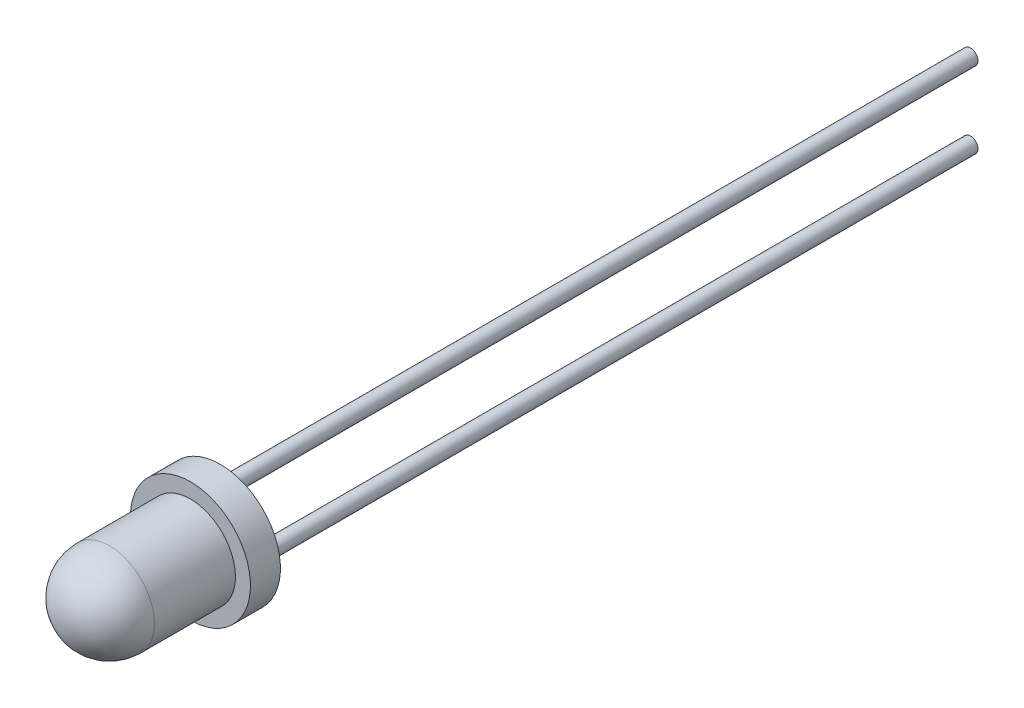
ISO-10303-21;
HEADER;
FILE_DESCRIPTION(('STEP AP214'),'2;1');
FILE_NAME('part.step','',(''),(''),'','','');
FILE_SCHEMA(('AUTOMOTIVE_DESIGN { 1 0 10303 214 1 1 1 1 }'));
ENDSEC;
DATA;
#1=APPLICATION_CONTEXT('core data for automotive mechanical design processes');
#2=APPLICATION_PROTOCOL_DEFINITION('international standard','automotive_design',2000,#1);
#3=PRODUCT_CONTEXT('',#1,'mechanical');
#4=PRODUCT('Part','Part','',(#3));
#5=PRODUCT_RELATED_PRODUCT_CATEGORY('part','',(#4));
#6=PRODUCT_DEFINITION_FORMATION('','',#4);
#7=PRODUCT_DEFINITION_CONTEXT('part definition',#1,'design');
#8=PRODUCT_DEFINITION('design','',#6,#7);
#9=PRODUCT_DEFINITION_SHAPE('','',#8);
#10=(LENGTH_UNIT() NAMED_UNIT(*) SI_UNIT(.MILLI.,.METRE.));
#11=(NAMED_UNIT(*) PLANE_ANGLE_UNIT() SI_UNIT($,.RADIAN.));
#12=(NAMED_UNIT(*) SI_UNIT($,.STERADIAN.) SOLID_ANGLE_UNIT());
#13=UNCERTAINTY_MEASURE_WITH_UNIT(LENGTH_MEASURE(1.E-05),#10,'distance_accuracy_value','');
#14=(GEOMETRIC_REPRESENTATION_CONTEXT(3) GLOBAL_UNCERTAINTY_ASSIGNED_CONTEXT((#13)) GLOBAL_UNIT_ASSIGNED_CONTEXT((#10,
#11,#12)) REPRESENTATION_CONTEXT('',''));
#15=CARTESIAN_POINT('',(0.,0.,0.));
#16=DIRECTION('',(0.,0.,1.));
#17=DIRECTION('',(1.,0.,0.));
#18=AXIS2_PLACEMENT_3D('',#15,#16,#17);
#19=CARTESIAN_POINT('',(0.,0.,4.2));
#20=DIRECTION('',(0.,0.,-1.));
#21=DIRECTION('',(-1.,0.,0.));
#22=AXIS2_PLACEMENT_3D('',#19,#20,#21);
#23=CYLINDRICAL_SURFACE('',#22,1.5);
#24=CARTESIAN_POINT('',(0.,0.,2.7));
#25=DIRECTION('',(0.,0.,-1.));
#26=DIRECTION('',(-1.,0.,0.));
#27=AXIS2_PLACEMENT_3D('',#24,#25,#26);
#28=CIRCLE('',#27,1.5);
#29=CARTESIAN_POINT('',(-1.5,0.,2.7));
#30=VERTEX_POINT('',#29);
#31=EDGE_CURVE('E104',#30,#30,#28,.T.);
#32=ORIENTED_EDGE('',*,*,#31,.T.);
#33=EDGE_LOOP('',(#32));
#34=FACE_BOUND('',#33,.T.);
#35=CARTESIAN_POINT('',(0.,0.,0.));
#36=DIRECTION('',(0.,0.,-1.));
#37=DIRECTION('',(-1.,0.,0.));
#38=AXIS2_PLACEMENT_3D('',#35,#36,#37);
#39=CIRCLE('',#38,1.5);
#40=CARTESIAN_POINT('',(-1.5,0.,0.));
#41=VERTEX_POINT('',#40);
#42=EDGE_CURVE('E99',#41,#41,#39,.T.);
#43=ORIENTED_EDGE('',*,*,#42,.F.);
#44=EDGE_LOOP('',(#43));
#45=FACE_BOUND('',#44,.T.);
#46=ADVANCED_FACE('F38',(#34,#45),#23,.T.);
#47=CARTESIAN_POINT('',(0.,0.,2.7));
#48=DIRECTION('',(0.,0.,1.));
#49=DIRECTION('',(1.,0.,0.));
#50=AXIS2_PLACEMENT_3D('',#47,#48,#49);
#51=SPHERICAL_SURFACE('',#50,1.5);
#52=ORIENTED_EDGE('',*,*,#31,.F.);
#53=EDGE_LOOP('',(#52));
#54=FACE_BOUND('',#53,.T.);
#55=ADVANCED_FACE('F132',(#54),#51,.T.);
#56=CARTESIAN_POINT('',(0.,0.,-1.));
#57=DIRECTION('',(0.,0.,1.));
#58=DIRECTION('',(1.,0.,0.));
#59=AXIS2_PLACEMENT_3D('',#56,#57,#58);
#60=CYLINDRICAL_SURFACE('',#59,2.);
#61=CARTESIAN_POINT('',(0.,0.,-1.));
#62=DIRECTION('',(0.,0.,-1.));
#63=DIRECTION('',(-1.,0.,0.));
#64=AXIS2_PLACEMENT_3D('',#61,#62,#63);
#65=CIRCLE('',#64,2.);
#66=CARTESIAN_POINT('',(-2.,0.,-1.));
#67=VERTEX_POINT('',#66);
#68=EDGE_CURVE('E96',#67,#67,#65,.T.);
#69=ORIENTED_EDGE('',*,*,#68,.F.);
#70=EDGE_LOOP('',(#69));
#71=FACE_BOUND('',#70,.T.);
#72=CARTESIAN_POINT('',(0.,0.,0.));
#73=DIRECTION('',(0.,0.,-1.));
#74=DIRECTION('',(-1.,0.,0.));
#75=AXIS2_PLACEMENT_3D('',#72,#73,#74);
#76=CIRCLE('',#75,2.);
#77=CARTESIAN_POINT('',(-2.,0.,0.));
#78=VERTEX_POINT('',#77);
#79=EDGE_CURVE('E71',#78,#78,#76,.T.);
#80=ORIENTED_EDGE('',*,*,#79,.T.);
#81=EDGE_LOOP('',(#80));
#82=FACE_BOUND('',#81,.T.);
#83=ADVANCED_FACE('F126',(#71,#82),#60,.T.);
#84=CARTESIAN_POINT('',(0.,0.,-1.));
#85=DIRECTION('',(0.,0.,-1.));
#86=DIRECTION('',(-1.,0.,0.));
#87=AXIS2_PLACEMENT_3D('',#84,#85,#86);
#88=PLANE('',#87);
#89=CARTESIAN_POINT('',(0.,-1.27,-1.));
#90=DIRECTION('',(0.,0.,-1.));
#91=DIRECTION('',(-1.,0.,0.));
#92=AXIS2_PLACEMENT_3D('',#89,#90,#91);
#93=CIRCLE('',#92,0.25);
#94=CARTESIAN_POINT('',(0.106415684222751,-1.49622047244094,-1.));
#95=VERTEX_POINT('',#94);
#96=CARTESIAN_POINT('',(-0.106415684222751,-1.49622047244094,-1.));
#97=VERTEX_POINT('',#96);
#98=EDGE_CURVE('E75',#95,#97,#93,.T.);
#99=ORIENTED_EDGE('',*,*,#98,.F.);
#100=CARTESIAN_POINT('',(0.,0.,-1.));
#101=DIRECTION('',(0.,0.,-1.));
#102=DIRECTION('',(-1.,0.,0.));
#103=AXIS2_PLACEMENT_3D('',#100,#101,#102);
#104=CIRCLE('',#103,1.5);
#105=CARTESIAN_POINT('',(0.106415684222752,1.49622047244094,-1.));
#106=VERTEX_POINT('',#105);
#107=EDGE_CURVE('E65',#106,#95,#104,.T.);
#108=ORIENTED_EDGE('',*,*,#107,.F.);
#109=CARTESIAN_POINT('',(0.,1.27,-1.));
#110=DIRECTION('',(0.,0.,-1.));
#111=DIRECTION('',(-1.,0.,0.));
#112=AXIS2_PLACEMENT_3D('',#109,#110,#111);
#113=CIRCLE('',#112,0.25);
#114=CARTESIAN_POINT('',(-0.106415684222751,1.49622047244094,-1.));
#115=VERTEX_POINT('',#114);
#116=EDGE_CURVE('E94',#115,#106,#113,.T.);
#117=ORIENTED_EDGE('',*,*,#116,.F.);
#118=EDGE_CURVE('E72',#97,#115,#104,.T.);
#119=ORIENTED_EDGE('',*,*,#118,.F.);
#120=EDGE_LOOP('',(#99,#108,#117,#119));
#121=FACE_BOUND('',#120,.T.);
#122=ORIENTED_EDGE('',*,*,#68,.T.);
#123=EDGE_LOOP('',(#122));
#124=FACE_BOUND('',#123,.T.);
#125=ADVANCED_FACE('F76',(#121,#124),#88,.T.);
#126=CARTESIAN_POINT('',(0.,0.,0.));
#127=DIRECTION('',(0.,0.,-1.));
#128=DIRECTION('',(-1.,0.,0.));
#129=AXIS2_PLACEMENT_3D('',#126,#127,#128);
#130=PLANE('',#129);
#131=ORIENTED_EDGE('',*,*,#42,.T.);
#132=EDGE_LOOP('',(#131));
#133=FACE_BOUND('',#132,.T.);
#134=ORIENTED_EDGE('',*,*,#79,.F.);
#135=EDGE_LOOP('',(#134));
#136=FACE_BOUND('',#135,.T.);
#137=ADVANCED_FACE('F122',(#133,#136),#130,.F.);
#138=CARTESIAN_POINT('',(0.,0.,-1.5));
#139=DIRECTION('',(0.,0.,-1.));
#140=DIRECTION('',(-1.,0.,0.));
#141=AXIS2_PLACEMENT_3D('',#138,#139,#140);
#142=PLANE('',#141);
#143=CARTESIAN_POINT('',(0.,0.,-1.5));
#144=DIRECTION('',(0.,0.,-1.));
#145=DIRECTION('',(-1.,0.,0.));
#146=AXIS2_PLACEMENT_3D('',#143,#144,#145);
#147=CIRCLE('',#146,1.);
#148=CARTESIAN_POINT('',(-1.,0.,-1.5));
#149=VERTEX_POINT('',#148);
#150=EDGE_CURVE('E107',#149,#149,#147,.T.);
#151=ORIENTED_EDGE('',*,*,#150,.T.);
#152=EDGE_LOOP('',(#151));
#153=FACE_BOUND('',#152,.T.);
#154=ADVANCED_FACE('F119',(#153),#142,.T.);
#155=CARTESIAN_POINT('',(0.,0.,-1.5));
#156=DIRECTION('',(0.,0.,1.));
#157=DIRECTION('',(1.,0.,0.));
#158=AXIS2_PLACEMENT_3D('',#155,#156,#157);
#159=CONICAL_SURFACE('',#158,1.,0.785398163397446);
#160=CARTESIAN_POINT('',(-0.105912034737506,-1.49645670866142,-0.9998));
#161=CARTESIAN_POINT('',(-0.118985530882756,-1.49034383876274,-1.00497380533922));
#162=CARTESIAN_POINT('',(-0.131178028123813,-1.48326350862652,-1.01099521371868));
#163=CARTESIAN_POINT('',(-0.153631408949689,-1.46769100470375,-1.02433803471055));
#164=CARTESIAN_POINT('',(-0.163909364321516,-1.45921272055828,-1.03164670191562));
#165=CARTESIAN_POINT('',(-0.184725750820342,-1.43920377241162,-1.04904534897251));
#166=CARTESIAN_POINT('',(-0.194797883921699,-1.42741634453143,-1.05939058312987));
#167=CARTESIAN_POINT('',(-0.212305714472714,-1.40287086815621,-1.08119355942588));
#168=CARTESIAN_POINT('',(-0.219729656076977,-1.39010878969365,-1.09265598151871));
#169=CARTESIAN_POINT('',(-0.233922181212585,-1.36017392520252,-1.11989922398407));
#170=CARTESIAN_POINT('',(-0.239822077303624,-1.34282901268487,-1.13594197543377));
#171=CARTESIAN_POINT('',(-0.247740720215172,-1.30799751174468,-1.16876606630962));
#172=CARTESIAN_POINT('',(-0.249759188246517,-1.29051091323593,-1.18554745870119));
#173=CARTESIAN_POINT('',(-0.250204005237497,-1.25556273061883,-1.21975521993903));
#174=CARTESIAN_POINT('',(-0.248569293489678,-1.23810652619961,-1.23718769116248));
#175=CARTESIAN_POINT('',(-0.24173477255258,-1.20390407126997,-1.2720666707157));
#176=CARTESIAN_POINT('',(-0.236533582426173,-1.18715809842843,-1.28951318186721));
#177=CARTESIAN_POINT('',(-0.223073588181716,-1.15595893013547,-1.32271880959084));
#178=CARTESIAN_POINT('',(-0.215068670849479,-1.14142772930417,-1.33850745610135));
#179=CARTESIAN_POINT('',(-0.195827351884466,-1.11367850003718,-1.36925790408943));
#180=CARTESIAN_POINT('',(-0.184596545175542,-1.10045825086107,-1.38422108413374));
#181=CARTESIAN_POINT('',(-0.163324790959822,-1.0803849749168,-1.40736114468122));
#182=CARTESIAN_POINT('',(-0.154342917987289,-1.07296784524692,-1.41602323631608));
#183=CARTESIAN_POINT('',(-0.134827132686172,-1.0591342720511,-1.43235440905635));
#184=CARTESIAN_POINT('',(-0.124295479722689,-1.05271639931545,-1.4400249056956));
#185=CARTESIAN_POINT('',(-0.104356506298617,-1.04261778905396,-1.45220369481327));
#186=CARTESIAN_POINT('',(-0.0952901193844546,-1.03865017724314,-1.45702854010391));
#187=CARTESIAN_POINT('',(-0.076273867094625,-1.03170548949875,-1.46551946599306));
#188=CARTESIAN_POINT('',(-0.0663253318017086,-1.02872695338597,-1.46918725435872));
#189=CARTESIAN_POINT('',(-0.0474472462789842,-1.02438606448341,-1.47455052161706));
#190=CARTESIAN_POINT('',(-0.0386262137694067,-1.02283654640068,-1.47647348338028));
#191=CARTESIAN_POINT('',(-0.0206934312584574,-1.02069474360952,-1.47913444240587));
#192=CARTESIAN_POINT('',(-0.0115818905566035,-1.02010178494957,-1.47987327395418));
#193=CARTESIAN_POINT('',(0.00668150278806067,-1.01992222919943,-1.48009682628794));
#194=CARTESIAN_POINT('',(0.0158333967501045,-1.0203372571161,-1.47957952201759));
#195=CARTESIAN_POINT('',(0.0338894581311526,-1.02214124802402,-1.47733682673414));
#196=CARTESIAN_POINT('',(0.042793494079681,-1.02353071802288,-1.47561080682027));
#197=CARTESIAN_POINT('',(0.0600520597366538,-1.02716079340279,-1.47112036506019));
#198=CARTESIAN_POINT('',(0.0684110245073492,-1.02939314522588,-1.46836601552887));
#199=CARTESIAN_POINT('',(0.0845530068372522,-1.03457953915415,-1.46200086802738));
#200=CARTESIAN_POINT('',(0.0923357878889793,-1.0375338754974,-1.45838972089484));
#201=CARTESIAN_POINT('',(0.11193201624513,-1.04606669922907,-1.44802565368745));
#202=CARTESIAN_POINT('',(0.123238901533022,-1.05213393866504,-1.4407162683123));
#203=CARTESIAN_POINT('',(0.144231259315966,-1.06542113363457,-1.42490331318606));
#204=CARTESIAN_POINT('',(0.153911643330935,-1.07264457357866,-1.41639614334034));
#205=CARTESIAN_POINT('',(0.176096511777509,-1.09168586428629,-1.39426228035643));
#206=CARTESIAN_POINT('',(0.187677222650053,-1.10402682475184,-1.38016156269531));
#207=CARTESIAN_POINT('',(0.207786282481997,-1.13001792336977,-1.3510618235121));
#208=CARTESIAN_POINT('',(0.216311944108939,-1.14366920080941,-1.33606202459522));
#209=CARTESIAN_POINT('',(0.230779800190659,-1.1724796733434,-1.30503216684439));
#210=CARTESIAN_POINT('',(0.236608484642438,-1.18767688454914,-1.28898473347982));
#211=CARTESIAN_POINT('',(0.245232545910398,-1.21879700840666,-1.25677661146828));
#212=CARTESIAN_POINT('',(0.248026616140888,-1.2347202305782,-1.24061587704991));
#213=CARTESIAN_POINT('',(0.250775697134881,-1.27051285584141,-1.20497695093739));
#214=CARTESIAN_POINT('',(0.24998172029994,-1.29048778836548,-1.18554108936442));
#215=CARTESIAN_POINT('',(0.243424193701,-1.33044801729457,-1.1474842410381));
#216=CARTESIAN_POINT('',(0.237662850793587,-1.35043330515907,-1.12886289627819));
#217=CARTESIAN_POINT('',(0.223500628955987,-1.38290412459649,-1.09917232391778));
#218=CARTESIAN_POINT('',(0.216631307239347,-1.39565854938512,-1.08766348280188));
#219=CARTESIAN_POINT('',(0.200320681217358,-1.42029623548495,-1.06568052938085));
#220=CARTESIAN_POINT('',(0.190891424574661,-1.43218325461786,-1.05520187576815));
#221=CARTESIAN_POINT('',(0.17011538174757,-1.45375832203417,-1.03636490206901));
#222=CARTESIAN_POINT('',(0.158965605396538,-1.46354444803713,-1.02790647381276));
#223=CARTESIAN_POINT('',(0.134243964051586,-1.48145950289604,-1.01252934926203));
#224=CARTESIAN_POINT('',(0.120644282889644,-1.48956682241922,-1.00563063675068));
#225=CARTESIAN_POINT('',(0.105912034742812,-1.49645670865893,-0.999800000002101));
#226=B_SPLINE_CURVE_WITH_KNOTS('',3,(#160,#161,#162,#163,#164,#165,#166,#167,#168,#169,#170,
#171,#172,#173,#174,#175,#176,#177,#178,#179,#180,#181,#182,#183,#184,#185,#186,#187,#188,#189,
#190,#191,#192,#193,#194,#195,#196,#197,#198,#199,#200,#201,#202,#203,#204,#205,#206,#207,#208,
#209,#210,#211,#212,#213,#214,#215,#216,#217,#218,#219,#220,#221,#222,#223,#224,#225),
.UNSPECIFIED.,.F.,.F.,(4,2,2,2,2,2,2,2,2,2,2,2,2,2,2,2,2,2,2,2,2,2,2,2,2,2,2,2,2,2,2,2,4),(0.,
0.0457996643651824,0.091169028509765,0.14679402792073,0.202662971653291,0.275335469066857,
0.348013186092356,0.421914736576678,0.495844917842911,0.564320851033198,0.632678730603295,
0.676113809975422,0.719486183080301,0.752403523625272,0.785272049757844,0.812633973911358,
0.839976611571666,0.867363358409288,0.894764365305154,0.921903739667342,0.949054192927432,
0.993104725971899,1.03729060296046,1.10301655218088,1.16880017522996,1.23714505054963,
1.30551934083681,1.38875348918235,1.47195067805455,1.52726726140515,1.58232789423152,
1.63325640945414,1.68480450520715),.UNSPECIFIED.);
#227=EDGE_CURVE('E11',#97,#95,#226,.T.);
#228=ORIENTED_EDGE('',*,*,#227,.F.);
#229=ORIENTED_EDGE('',*,*,#118,.T.);
#230=CARTESIAN_POINT('',(0.105912034742812,1.49645670865893,-0.999800000002101));
#231=CARTESIAN_POINT('',(0.118985530888068,1.49034383875988,-1.00497380534165));
#232=CARTESIAN_POINT('',(0.13117802812908,1.48326350862329,-1.01099521372143));
#233=CARTESIAN_POINT('',(0.153631408954786,1.4676910046998,-1.02433803471395));
#234=CARTESIAN_POINT('',(0.163909364326489,1.45921272055398,-1.03164670191933));
#235=CARTESIAN_POINT('',(0.184725750825029,1.43920377240653,-1.04904534897697));
#236=CARTESIAN_POINT('',(0.194797883926195,1.42741634452589,-1.05939058313476));
#237=CARTESIAN_POINT('',(0.212305714476734,1.40287086814981,-1.0811935594316));
#238=CARTESIAN_POINT('',(0.219729656080711,1.39010878968685,-1.09265598152484));
#239=CARTESIAN_POINT('',(0.233922181215544,1.36017392519489,-1.11989922399109));
#240=CARTESIAN_POINT('',(0.23982207730608,1.34282901267683,-1.13594197544124));
#241=CARTESIAN_POINT('',(0.247740720216531,1.30799751173593,-1.16876606631796));
#242=CARTESIAN_POINT('',(0.249759188247281,1.29051091322686,-1.18554745870994));
#243=CARTESIAN_POINT('',(0.250204005236962,1.25556273060923,-1.21975521994855));
#244=CARTESIAN_POINT('',(0.248569293488441,1.23810652618979,-1.23718769117235));
#245=CARTESIAN_POINT('',(0.241734772549828,1.20390407125982,-1.27206667072619));
#246=CARTESIAN_POINT('',(0.236533582422607,1.18715809841817,-1.28951318187798));
#247=CARTESIAN_POINT('',(0.223073588176825,1.15595893012599,-1.32271880960108));
#248=CARTESIAN_POINT('',(0.215068670844268,1.14142772929553,-1.33850745611081));
#249=CARTESIAN_POINT('',(0.195827351878836,1.11367850003019,-1.3692579040973));
#250=CARTESIAN_POINT('',(0.184596545169813,1.10045825085489,-1.38422108414079));
#251=CARTESIAN_POINT('',(0.163324790954037,1.08038497491183,-1.407361144687));
#252=CARTESIAN_POINT('',(0.154342917981462,1.07296784524237,-1.41602323632142));
#253=CARTESIAN_POINT('',(0.134827132680338,1.05913427204738,-1.43235440906078));
#254=CARTESIAN_POINT('',(0.12429547971689,1.05271639931214,-1.44002490569956));
#255=CARTESIAN_POINT('',(0.104356506292921,1.04261778905135,-1.45220369481644));
#256=CARTESIAN_POINT('',(0.0952901193787999,1.03865017724082,-1.45702854010674));
#257=CARTESIAN_POINT('',(0.0762738670891187,1.03170548949699,-1.46551946599521));
#258=CARTESIAN_POINT('',(0.0663253317963091,1.02872695338449,-1.46918725436054));
#259=CARTESIAN_POINT('',(0.0474472462737104,1.02438606448239,-1.47455052161832));
#260=CARTESIAN_POINT('',(0.0386262137641311,1.02283654639986,-1.4764734833813));
#261=CARTESIAN_POINT('',(0.02069343125323,1.02069474360908,-1.47913444240641));
#262=CARTESIAN_POINT('',(0.0115818905514261,1.02010178494933,-1.47987327395448));
#263=CARTESIAN_POINT('',(-0.00668150279307599,1.01992222919956,-1.48009682628777));
#264=CARTESIAN_POINT('',(-0.0158333967550076,1.02033725711642,-1.4795795220172));
#265=CARTESIAN_POINT('',(-0.0338894581357915,1.02214124802466,-1.47733682673335));
#266=CARTESIAN_POINT('',(-0.0427934940841681,1.02353071802367,-1.4756108068193));
#267=CARTESIAN_POINT('',(-0.0600520597409776,1.02716079340386,-1.47112036505887));
#268=CARTESIAN_POINT('',(-0.0684110245116535,1.0293931452271,-1.46836601552737));
#269=CARTESIAN_POINT('',(-0.0845530068414933,1.03457953915568,-1.46200086802552));
#270=CARTESIAN_POINT('',(-0.0923357878931766,1.03753387549907,-1.45838972089281));
#271=CARTESIAN_POINT('',(-0.111932016249424,1.0460666992312,-1.44802565368487));
#272=CARTESIAN_POINT('',(-0.123238901537413,1.05213393866751,-1.44071626830934));
#273=CARTESIAN_POINT('',(-0.144231259320474,1.06542113363773,-1.42490331318232));
#274=CARTESIAN_POINT('',(-0.153911643335463,1.07264457358218,-1.41639614333621));
#275=CARTESIAN_POINT('',(-0.176096511781979,1.09168586429068,-1.39426228035139));
#276=CARTESIAN_POINT('',(-0.187677222654413,1.10402682475674,-1.38016156268974));
#277=CARTESIAN_POINT('',(-0.207786282486018,1.13001792337571,-1.35106182350554));
#278=CARTESIAN_POINT('',(-0.216311944112731,1.14366920081587,-1.33606202458817));
#279=CARTESIAN_POINT('',(-0.230779800193841,1.17247967335088,-1.30503216683644));
#280=CARTESIAN_POINT('',(-0.23660848464524,1.18767688455713,-1.28898473347144));
#281=CARTESIAN_POINT('',(-0.245232545912296,1.21879700841564,-1.2567766114591));
#282=CARTESIAN_POINT('',(-0.248026616142261,1.23472023058766,-1.24061587704036));
#283=CARTESIAN_POINT('',(-0.250775697134871,1.27051285585155,-1.20497695092745));
#284=CARTESIAN_POINT('',(-0.249981720299116,1.29048778837578,-1.18554108935447));
#285=CARTESIAN_POINT('',(-0.243424193698413,1.33044801730506,-1.14748424102825));
#286=CARTESIAN_POINT('',(-0.237662850790057,1.35043330516958,-1.12886289626845));
#287=CARTESIAN_POINT('',(-0.223500628950979,1.38290412460636,-1.09917232390883));
#288=CARTESIAN_POINT('',(-0.216631307233944,1.39565854939439,-1.08766348279355));
#289=CARTESIAN_POINT('',(-0.200320681211307,1.42029623549298,-1.06568052937375));
#290=CARTESIAN_POINT('',(-0.190891424568357,1.43218325462525,-1.05520187576166));
#291=CARTESIAN_POINT('',(-0.170115381741064,1.45375832204015,-1.03636490206382));
#292=CARTESIAN_POINT('',(-0.158965605390098,1.46354444804238,-1.02790647380823));
#293=CARTESIAN_POINT('',(-0.134243964045519,1.48145950289985,-1.01252934925878));
#294=CARTESIAN_POINT('',(-0.12064428288389,1.48956682242233,-1.00563063674803));
#295=CARTESIAN_POINT('',(-0.105912034737506,1.49645670866142,-0.9998));
#296=B_SPLINE_CURVE_WITH_KNOTS('',3,(#230,#231,#232,#233,#234,#235,#236,#237,#238,#239,#240,
#241,#242,#243,#244,#245,#246,#247,#248,#249,#250,#251,#252,#253,#254,#255,#256,#257,#258,#259,
#260,#261,#262,#263,#264,#265,#266,#267,#268,#269,#270,#271,#272,#273,#274,#275,#276,#277,#278,
#279,#280,#281,#282,#283,#284,#285,#286,#287,#288,#289,#290,#291,#292,#293,#294,#295),
.UNSPECIFIED.,.F.,.F.,(4,2,2,2,2,2,2,2,2,2,2,2,2,2,2,2,2,2,2,2,2,2,2,2,2,2,2,2,2,2,2,2,4),(0.,
0.045799664365974,0.0911690285113432,0.146794027923553,0.202662971657366,0.275335469072313,
0.348013186099194,0.421914736584843,0.495844917852391,0.564320851039833,0.632678730607082,
0.676113809977848,0.719486183081368,0.752403523625488,0.785272049757211,0.812633973910478,
0.839976611570542,0.867363358407895,0.894764365303494,0.921903739665914,0.949054192926237,
0.993104725971918,1.0372906029617,1.10301655218381,1.16880017523456,1.23714505055582,
1.30551934084461,1.38875348919057,1.47195067806316,1.52726726141184,1.58232789423629,
1.63325640945655,1.68480450520715),.UNSPECIFIED.);
#297=EDGE_CURVE('E51',#106,#115,#296,.T.);
#298=ORIENTED_EDGE('',*,*,#297,.F.);
#299=ORIENTED_EDGE('',*,*,#107,.T.);
#300=EDGE_LOOP('',(#228,#229,#298,#299));
#301=FACE_BOUND('',#300,.T.);
#302=ORIENTED_EDGE('',*,*,#150,.F.);
#303=EDGE_LOOP('',(#302));
#304=FACE_BOUND('',#303,.T.);
#305=ADVANCED_FACE('F40',(#301,#304),#159,.T.);
#306=CARTESIAN_POINT('',(0.,1.27,-1.));
#307=DIRECTION('',(0.,0.,-1.));
#308=DIRECTION('',(-1.,0.,0.));
#309=AXIS2_PLACEMENT_3D('',#306,#307,#308);
#310=CYLINDRICAL_SURFACE('',#309,0.25);
#311=ORIENTED_EDGE('',*,*,#116,.T.);
#312=ORIENTED_EDGE('',*,*,#297,.T.);
#313=EDGE_LOOP('',(#311,#312));
#314=FACE_BOUND('',#313,.T.);
#315=CARTESIAN_POINT('',(0.,1.27,-26.));
#316=DIRECTION('',(0.,0.,-1.));
#317=DIRECTION('',(-1.,0.,0.));
#318=AXIS2_PLACEMENT_3D('',#315,#316,#317);
#319=CIRCLE('',#318,0.25);
#320=CARTESIAN_POINT('',(-0.25,1.27,-26.));
#321=VERTEX_POINT('',#320);
#322=EDGE_CURVE('E79',#321,#321,#319,.T.);
#323=ORIENTED_EDGE('',*,*,#322,.F.);
#324=EDGE_LOOP('',(#323));
#325=FACE_BOUND('',#324,.T.);
#326=ADVANCED_FACE('F113',(#314,#325),#310,.T.);
#327=CARTESIAN_POINT('',(0.,1.27,-26.));
#328=DIRECTION('',(0.,0.,-1.));
#329=DIRECTION('',(-1.,0.,0.));
#330=AXIS2_PLACEMENT_3D('',#327,#328,#329);
#331=PLANE('',#330);
#332=ORIENTED_EDGE('',*,*,#322,.T.);
#333=EDGE_LOOP('',(#332));
#334=FACE_BOUND('',#333,.T.);
#335=ADVANCED_FACE('F86',(#334),#331,.T.);
#336=CARTESIAN_POINT('',(0.,-1.27,-1.));
#337=DIRECTION('',(0.,0.,-1.));
#338=DIRECTION('',(-1.,0.,0.));
#339=AXIS2_PLACEMENT_3D('',#336,#337,#338);
#340=CYLINDRICAL_SURFACE('',#339,0.25);
#341=ORIENTED_EDGE('',*,*,#98,.T.);
#342=ORIENTED_EDGE('',*,*,#227,.T.);
#343=EDGE_LOOP('',(#341,#342));
#344=FACE_BOUND('',#343,.T.);
#345=CARTESIAN_POINT('',(0.,-1.27,-26.));
#346=DIRECTION('',(0.,0.,-1.));
#347=DIRECTION('',(-1.,0.,0.));
#348=AXIS2_PLACEMENT_3D('',#345,#346,#347);
#349=CIRCLE('',#348,0.25);
#350=CARTESIAN_POINT('',(-0.25,-1.27,-26.));
#351=VERTEX_POINT('',#350);
#352=EDGE_CURVE('E80',#351,#351,#349,.T.);
#353=ORIENTED_EDGE('',*,*,#352,.F.);
#354=EDGE_LOOP('',(#353));
#355=FACE_BOUND('',#354,.T.);
#356=ADVANCED_FACE('F82',(#344,#355),#340,.T.);
#357=CARTESIAN_POINT('',(0.,-1.27,-26.));
#358=DIRECTION('',(0.,0.,-1.));
#359=DIRECTION('',(-1.,0.,0.));
#360=AXIS2_PLACEMENT_3D('',#357,#358,#359);
#361=PLANE('',#360);
#362=ORIENTED_EDGE('',*,*,#352,.T.);
#363=EDGE_LOOP('',(#362));
#364=FACE_BOUND('',#363,.T.);
#365=ADVANCED_FACE('F85',(#364),#361,.T.);
#366=CLOSED_SHELL('',(#46,#55,#83,#125,#137,#154,#305,#326,#335,#356,#365));
#367=MANIFOLD_SOLID_BREP('B2',#366);
#368=ADVANCED_BREP_SHAPE_REPRESENTATION('',(#18,#367),#14);
#369=SHAPE_DEFINITION_REPRESENTATION(#9,#368);
ENDSEC;
END-ISO-10303-21;
